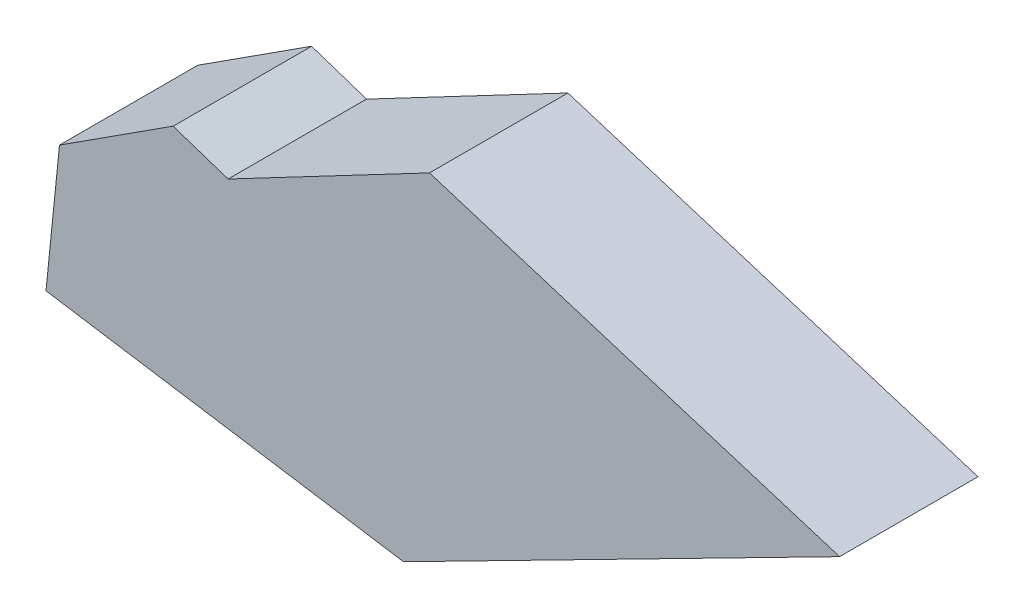
ISO-10303-21;
HEADER;
FILE_DESCRIPTION(('STEP AP214'),'2;1');
FILE_NAME('part.step','',(''),(''),'','','');
FILE_SCHEMA(('AUTOMOTIVE_DESIGN { 1 0 10303 214 1 1 1 1 }'));
ENDSEC;
DATA;
#1=APPLICATION_CONTEXT('core data for automotive mechanical design processes');
#2=APPLICATION_PROTOCOL_DEFINITION('international standard','automotive_design',2000,#1);
#3=PRODUCT_CONTEXT('',#1,'mechanical');
#4=PRODUCT('Part','Part','',(#3));
#5=PRODUCT_RELATED_PRODUCT_CATEGORY('part','',(#4));
#6=PRODUCT_DEFINITION_FORMATION('','',#4);
#7=PRODUCT_DEFINITION_CONTEXT('part definition',#1,'design');
#8=PRODUCT_DEFINITION('design','',#6,#7);
#9=PRODUCT_DEFINITION_SHAPE('','',#8);
#10=(LENGTH_UNIT() NAMED_UNIT(*) SI_UNIT(.MILLI.,.METRE.));
#11=(NAMED_UNIT(*) PLANE_ANGLE_UNIT() SI_UNIT($,.RADIAN.));
#12=(NAMED_UNIT(*) SI_UNIT($,.STERADIAN.) SOLID_ANGLE_UNIT());
#13=UNCERTAINTY_MEASURE_WITH_UNIT(LENGTH_MEASURE(1.E-05),#10,'distance_accuracy_value','');
#14=(GEOMETRIC_REPRESENTATION_CONTEXT(3) GLOBAL_UNCERTAINTY_ASSIGNED_CONTEXT((#13)) GLOBAL_UNIT_ASSIGNED_CONTEXT((#10,
#11,#12)) REPRESENTATION_CONTEXT('',''));
#15=CARTESIAN_POINT('',(0.,0.,0.));
#16=DIRECTION('',(0.,0.,1.));
#17=DIRECTION('',(1.,0.,0.));
#18=AXIS2_PLACEMENT_3D('',#15,#16,#17);
#19=CARTESIAN_POINT('',(-57.0825625214114,16.7070914696814,40.));
#20=DIRECTION('',(-0.316227766016838,-0.948683298050514,0.));
#21=DIRECTION('',(0.948683298050514,-0.316227766016838,0.));
#22=AXIS2_PLACEMENT_3D('',#19,#20,#21);
#23=PLANE('',#22);
#24=DIRECTION('',(-0.948683298050514,0.316227766016838,0.));
#25=VECTOR('',#24,1.);
#26=CARTESIAN_POINT('',(-57.0825625214114,16.7070914696814,0.));
#27=LINE('',#26,#25);
#28=CARTESIAN_POINT('',(-41.2108256252141,11.4165125042823,0.));
#29=VERTEX_POINT('',#28);
#30=CARTESIAN_POINT('',(-57.0825625214114,16.7070914696814,0.));
#31=VERTEX_POINT('',#30);
#32=EDGE_CURVE('E126',#29,#31,#27,.T.);
#33=ORIENTED_EDGE('',*,*,#32,.T.);
#34=DIRECTION('',(0.,0.,-1.));
#35=VECTOR('',#34,1.);
#36=CARTESIAN_POINT('',(-57.0825625214114,16.7070914696814,40.));
#37=LINE('',#36,#35);
#38=CARTESIAN_POINT('',(-57.0825625214114,16.7070914696814,40.));
#39=VERTEX_POINT('',#38);
#40=EDGE_CURVE('E11',#39,#31,#37,.T.);
#41=ORIENTED_EDGE('',*,*,#40,.F.);
#42=DIRECTION('',(-0.948683298050514,0.316227766016838,0.));
#43=VECTOR('',#42,1.);
#44=CARTESIAN_POINT('',(-57.0825625214114,16.7070914696814,40.));
#45=LINE('',#44,#43);
#46=CARTESIAN_POINT('',(-41.2108256252141,11.4165125042823,40.));
#47=VERTEX_POINT('',#46);
#48=EDGE_CURVE('E138',#47,#39,#45,.T.);
#49=ORIENTED_EDGE('',*,*,#48,.F.);
#50=DIRECTION('',(0.,0.,-1.));
#51=VECTOR('',#50,1.);
#52=CARTESIAN_POINT('',(-41.2108256252141,11.4165125042823,40.));
#53=LINE('',#52,#51);
#54=EDGE_CURVE('E122',#47,#29,#53,.T.);
#55=ORIENTED_EDGE('',*,*,#54,.T.);
#56=EDGE_LOOP('',(#33,#41,#49,#55));
#57=FACE_BOUND('',#56,.T.);
#58=ADVANCED_FACE('F36',(#57),#23,.F.);
#59=CARTESIAN_POINT('',(-89.9398424117849,-4.45522439191504,40.));
#60=DIRECTION('',(0.541477579908113,-0.840715189857334,0.));
#61=DIRECTION('',(0.840715189857334,0.541477579908113,0.));
#62=AXIS2_PLACEMENT_3D('',#59,#60,#61);
#63=PLANE('',#62);
#64=DIRECTION('',(-0.840715189857334,-0.541477579908113,0.));
#65=VECTOR('',#64,1.);
#66=CARTESIAN_POINT('',(-89.9398424117849,-4.45522439191504,0.));
#67=LINE('',#66,#65);
#68=CARTESIAN_POINT('',(-89.9398424117849,-4.45522439191504,0.));
#69=VERTEX_POINT('',#68);
#70=EDGE_CURVE('E129',#31,#69,#67,.T.);
#71=ORIENTED_EDGE('',*,*,#70,.T.);
#72=DIRECTION('',(0.,0.,-1.));
#73=VECTOR('',#72,1.);
#74=CARTESIAN_POINT('',(-89.9398424117849,-4.45522439191504,40.));
#75=LINE('',#74,#73);
#76=CARTESIAN_POINT('',(-89.9398424117849,-4.45522439191504,40.));
#77=VERTEX_POINT('',#76);
#78=EDGE_CURVE('E44',#77,#69,#75,.T.);
#79=ORIENTED_EDGE('',*,*,#78,.F.);
#80=DIRECTION('',(-0.840715189857334,-0.541477579908113,0.));
#81=VECTOR('',#80,1.);
#82=CARTESIAN_POINT('',(-89.9398424117849,-4.45522439191504,40.));
#83=LINE('',#82,#81);
#84=EDGE_CURVE('E92',#39,#77,#83,.T.);
#85=ORIENTED_EDGE('',*,*,#84,.F.);
#86=ORIENTED_EDGE('',*,*,#40,.T.);
#87=EDGE_LOOP('',(#71,#79,#85,#86));
#88=FACE_BOUND('',#87,.T.);
#89=ADVANCED_FACE('F163',(#88),#63,.F.);
#90=CARTESIAN_POINT('',(-93.8381637547105,-42.8815347721822,40.));
#91=DIRECTION('',(0.994893406256615,-0.100931215127483,0.));
#92=DIRECTION('',(0.100931215127483,0.994893406256615,0.));
#93=AXIS2_PLACEMENT_3D('',#90,#91,#92);
#94=PLANE('',#93);
#95=DIRECTION('',(-0.100931215127483,-0.994893406256615,0.));
#96=VECTOR('',#95,1.);
#97=CARTESIAN_POINT('',(-93.8381637547105,-42.8815347721822,0.));
#98=LINE('',#97,#96);
#99=CARTESIAN_POINT('',(-93.8381637547105,-42.8815347721822,0.));
#100=VERTEX_POINT('',#99);
#101=EDGE_CURVE('E131',#69,#100,#98,.T.);
#102=ORIENTED_EDGE('',*,*,#101,.T.);
#103=DIRECTION('',(0.,0.,-1.));
#104=VECTOR('',#103,1.);
#105=CARTESIAN_POINT('',(-93.8381637547105,-42.8815347721822,40.));
#106=LINE('',#105,#104);
#107=CARTESIAN_POINT('',(-93.8381637547105,-42.8815347721822,40.));
#108=VERTEX_POINT('',#107);
#109=EDGE_CURVE('E142',#108,#100,#106,.T.);
#110=ORIENTED_EDGE('',*,*,#109,.F.);
#111=DIRECTION('',(-0.100931215127483,-0.994893406256615,0.));
#112=VECTOR('',#111,1.);
#113=CARTESIAN_POINT('',(-93.8381637547105,-42.8815347721822,40.));
#114=LINE('',#113,#112);
#115=EDGE_CURVE('E150',#77,#108,#114,.T.);
#116=ORIENTED_EDGE('',*,*,#115,.F.);
#117=ORIENTED_EDGE('',*,*,#78,.T.);
#118=EDGE_LOOP('',(#102,#110,#116,#117));
#119=FACE_BOUND('',#118,.T.);
#120=ADVANCED_FACE('F148',(#119),#94,.F.);
#121=CARTESIAN_POINT('',(9.46735183281949,-59.0317231928743,40.));
#122=DIRECTION('',(0.154458117379655,0.98799933703193,0.));
#123=DIRECTION('',(-0.98799933703193,0.154458117379655,0.));
#124=AXIS2_PLACEMENT_3D('',#121,#122,#123);
#125=PLANE('',#124);
#126=DIRECTION('',(0.98799933703193,-0.154458117379655,0.));
#127=VECTOR('',#126,1.);
#128=CARTESIAN_POINT('',(9.46735183281949,-59.0317231928743,0.));
#129=LINE('',#128,#127);
#130=CARTESIAN_POINT('',(9.46735183281949,-59.0317231928743,0.));
#131=VERTEX_POINT('',#130);
#132=EDGE_CURVE('E133',#100,#131,#129,.T.);
#133=ORIENTED_EDGE('',*,*,#132,.T.);
#134=DIRECTION('',(0.,0.,-1.));
#135=VECTOR('',#134,1.);
#136=CARTESIAN_POINT('',(9.46735183281949,-59.0317231928743,40.));
#137=LINE('',#136,#135);
#138=CARTESIAN_POINT('',(9.46735183281949,-59.0317231928743,40.));
#139=VERTEX_POINT('',#138);
#140=EDGE_CURVE('E117',#139,#131,#137,.T.);
#141=ORIENTED_EDGE('',*,*,#140,.F.);
#142=DIRECTION('',(0.98799933703193,-0.154458117379655,0.));
#143=VECTOR('',#142,1.);
#144=CARTESIAN_POINT('',(9.46735183281949,-59.0317231928743,40.));
#145=LINE('',#144,#143);
#146=EDGE_CURVE('E108',#108,#139,#145,.T.);
#147=ORIENTED_EDGE('',*,*,#146,.F.);
#148=ORIENTED_EDGE('',*,*,#109,.T.);
#149=EDGE_LOOP('',(#133,#141,#147,#148));
#150=FACE_BOUND('',#149,.T.);
#151=ADVANCED_FACE('F156',(#150),#125,.F.);
#152=CARTESIAN_POINT('',(135.510759858182,5.26249220642226,40.));
#153=DIRECTION('',(-0.454393818424437,0.890800908047168,0.));
#154=DIRECTION('',(-0.890800908047168,-0.454393818424437,0.));
#155=AXIS2_PLACEMENT_3D('',#152,#153,#154);
#156=PLANE('',#155);
#157=DIRECTION('',(0.890800908047168,0.454393818424437,0.));
#158=VECTOR('',#157,1.);
#159=CARTESIAN_POINT('',(135.510759858182,5.26249220642226,0.));
#160=LINE('',#159,#158);
#161=CARTESIAN_POINT('',(135.510759858182,5.26249220642226,0.));
#162=VERTEX_POINT('',#161);
#163=EDGE_CURVE('E116',#131,#162,#160,.T.);
#164=ORIENTED_EDGE('',*,*,#163,.T.);
#165=DIRECTION('',(0.,0.,-1.));
#166=VECTOR('',#165,1.);
#167=CARTESIAN_POINT('',(135.510759858182,5.26249220642226,40.));
#168=LINE('',#167,#166);
#169=CARTESIAN_POINT('',(135.510759858182,5.26249220642226,40.));
#170=VERTEX_POINT('',#169);
#171=EDGE_CURVE('E113',#170,#162,#168,.T.);
#172=ORIENTED_EDGE('',*,*,#171,.F.);
#173=DIRECTION('',(0.890800908047168,0.454393818424437,0.));
#174=VECTOR('',#173,1.);
#175=CARTESIAN_POINT('',(135.510759858182,5.26249220642226,40.));
#176=LINE('',#175,#174);
#177=EDGE_CURVE('E102',#139,#170,#176,.T.);
#178=ORIENTED_EDGE('',*,*,#177,.F.);
#179=ORIENTED_EDGE('',*,*,#140,.T.);
#180=EDGE_LOOP('',(#164,#172,#178,#179));
#181=FACE_BOUND('',#180,.T.);
#182=ADVANCED_FACE('F114',(#181),#156,.F.);
#183=CARTESIAN_POINT('',(16.9855429941761,42.0461801986982,40.));
#184=DIRECTION('',(-0.296399214872441,-0.955064136811241,0.));
#185=DIRECTION('',(0.955064136811241,-0.296399214872441,0.));
#186=AXIS2_PLACEMENT_3D('',#183,#184,#185);
#187=PLANE('',#186);
#188=DIRECTION('',(-0.955064136811241,0.296399214872441,0.));
#189=VECTOR('',#188,1.);
#190=CARTESIAN_POINT('',(16.9855429941761,42.0461801986982,0.));
#191=LINE('',#190,#189);
#192=CARTESIAN_POINT('',(16.9855429941761,42.0461801986982,0.));
#193=VERTEX_POINT('',#192);
#194=EDGE_CURVE('E78',#162,#193,#191,.T.);
#195=ORIENTED_EDGE('',*,*,#194,.T.);
#196=DIRECTION('',(0.,0.,-1.));
#197=VECTOR('',#196,1.);
#198=CARTESIAN_POINT('',(16.9855429941761,42.0461801986982,40.));
#199=LINE('',#198,#197);
#200=CARTESIAN_POINT('',(16.9855429941761,42.0461801986982,40.));
#201=VERTEX_POINT('',#200);
#202=EDGE_CURVE('E118',#201,#193,#199,.T.);
#203=ORIENTED_EDGE('',*,*,#202,.F.);
#204=DIRECTION('',(-0.955064136811241,0.296399214872441,0.));
#205=VECTOR('',#204,1.);
#206=CARTESIAN_POINT('',(16.9855429941761,42.0461801986982,40.));
#207=LINE('',#206,#205);
#208=EDGE_CURVE('E106',#170,#201,#207,.T.);
#209=ORIENTED_EDGE('',*,*,#208,.F.);
#210=ORIENTED_EDGE('',*,*,#171,.T.);
#211=EDGE_LOOP('',(#195,#203,#209,#210));
#212=FACE_BOUND('',#211,.T.);
#213=ADVANCED_FACE('F120',(#212),#187,.F.);
#214=CARTESIAN_POINT('',(-41.2108256252141,11.4165125042823,40.));
#215=DIRECTION('',(0.465746432832622,-0.884918222381982,0.));
#216=DIRECTION('',(0.884918222381982,0.465746432832622,0.));
#217=AXIS2_PLACEMENT_3D('',#214,#215,#216);
#218=PLANE('',#217);
#219=DIRECTION('',(-0.884918222381982,-0.465746432832622,0.));
#220=VECTOR('',#219,1.);
#221=CARTESIAN_POINT('',(-41.2108256252141,11.4165125042823,0.));
#222=LINE('',#221,#220);
#223=EDGE_CURVE('E84',#193,#29,#222,.T.);
#224=ORIENTED_EDGE('',*,*,#223,.T.);
#225=ORIENTED_EDGE('',*,*,#54,.F.);
#226=DIRECTION('',(-0.884918222381982,-0.465746432832622,0.));
#227=VECTOR('',#226,1.);
#228=CARTESIAN_POINT('',(-41.2108256252141,11.4165125042823,40.));
#229=LINE('',#228,#227);
#230=EDGE_CURVE('E52',#201,#47,#229,.T.);
#231=ORIENTED_EDGE('',*,*,#230,.F.);
#232=ORIENTED_EDGE('',*,*,#202,.T.);
#233=EDGE_LOOP('',(#224,#225,#231,#232));
#234=FACE_BOUND('',#233,.T.);
#235=ADVANCED_FACE('F177',(#234),#218,.F.);
#236=CARTESIAN_POINT('',(0.,0.,40.));
#237=DIRECTION('',(0.,0.,1.));
#238=DIRECTION('',(1.,0.,0.));
#239=AXIS2_PLACEMENT_3D('',#236,#237,#238);
#240=PLANE('',#239);
#241=ORIENTED_EDGE('',*,*,#48,.T.);
#242=ORIENTED_EDGE('',*,*,#84,.T.);
#243=ORIENTED_EDGE('',*,*,#115,.T.);
#244=ORIENTED_EDGE('',*,*,#146,.T.);
#245=ORIENTED_EDGE('',*,*,#177,.T.);
#246=ORIENTED_EDGE('',*,*,#208,.T.);
#247=ORIENTED_EDGE('',*,*,#230,.T.);
#248=EDGE_LOOP('',(#241,#242,#243,#244,#245,#246,#247));
#249=FACE_BOUND('',#248,.T.);
#250=ADVANCED_FACE('F104',(#249),#240,.T.);
#251=CARTESIAN_POINT('',(0.,0.,0.));
#252=DIRECTION('',(0.,0.,1.));
#253=DIRECTION('',(1.,0.,0.));
#254=AXIS2_PLACEMENT_3D('',#251,#252,#253);
#255=PLANE('',#254);
#256=ORIENTED_EDGE('',*,*,#32,.F.);
#257=ORIENTED_EDGE('',*,*,#223,.F.);
#258=ORIENTED_EDGE('',*,*,#194,.F.);
#259=ORIENTED_EDGE('',*,*,#163,.F.);
#260=ORIENTED_EDGE('',*,*,#132,.F.);
#261=ORIENTED_EDGE('',*,*,#101,.F.);
#262=ORIENTED_EDGE('',*,*,#70,.F.);
#263=EDGE_LOOP('',(#256,#257,#258,#259,#260,#261,#262));
#264=FACE_BOUND('',#263,.T.);
#265=ADVANCED_FACE('F154',(#264),#255,.F.);
#266=CLOSED_SHELL('',(#58,#89,#120,#151,#182,#213,#235,#250,#265));
#267=MANIFOLD_SOLID_BREP('B2',#266);
#268=ADVANCED_BREP_SHAPE_REPRESENTATION('',(#18,#267),#14);
#269=SHAPE_DEFINITION_REPRESENTATION(#9,#268);
ENDSEC;
END-ISO-10303-21;
